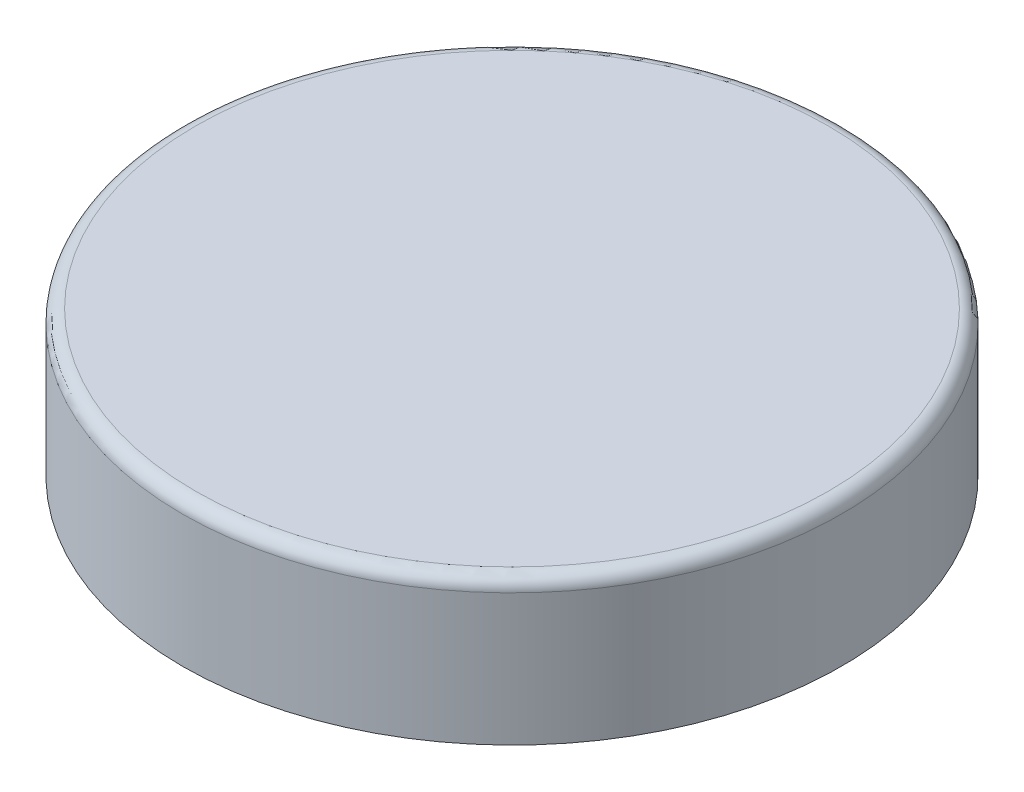
ISO-10303-21;
HEADER;
FILE_DESCRIPTION(('STEP AP214'),'2;1');
FILE_NAME('part.step','',(''),(''),'','','');
FILE_SCHEMA(('AUTOMOTIVE_DESIGN { 1 0 10303 214 1 1 1 1 }'));
ENDSEC;
DATA;
#1=APPLICATION_CONTEXT('core data for automotive mechanical design processes');
#2=APPLICATION_PROTOCOL_DEFINITION('international standard','automotive_design',2000,#1);
#3=PRODUCT_CONTEXT('',#1,'mechanical');
#4=PRODUCT('Part','Part','',(#3));
#5=PRODUCT_RELATED_PRODUCT_CATEGORY('part','',(#4));
#6=PRODUCT_DEFINITION_FORMATION('','',#4);
#7=PRODUCT_DEFINITION_CONTEXT('part definition',#1,'design');
#8=PRODUCT_DEFINITION('design','',#6,#7);
#9=PRODUCT_DEFINITION_SHAPE('','',#8);
#10=(LENGTH_UNIT() NAMED_UNIT(*) SI_UNIT(.MILLI.,.METRE.));
#11=(NAMED_UNIT(*) PLANE_ANGLE_UNIT() SI_UNIT($,.RADIAN.));
#12=(NAMED_UNIT(*) SI_UNIT($,.STERADIAN.) SOLID_ANGLE_UNIT());
#13=UNCERTAINTY_MEASURE_WITH_UNIT(LENGTH_MEASURE(1.E-05),#10,'distance_accuracy_value','');
#14=(GEOMETRIC_REPRESENTATION_CONTEXT(3) GLOBAL_UNCERTAINTY_ASSIGNED_CONTEXT((#13)) GLOBAL_UNIT_ASSIGNED_CONTEXT((#10,
#11,#12)) REPRESENTATION_CONTEXT('',''));
#15=CARTESIAN_POINT('',(0.,0.,0.));
#16=DIRECTION('',(0.,0.,1.));
#17=DIRECTION('',(1.,0.,0.));
#18=AXIS2_PLACEMENT_3D('',#15,#16,#17);
#19=CARTESIAN_POINT('',(0.,11.,0.));
#20=DIRECTION('',(0.,-1.,0.));
#21=DIRECTION('',(0.,0.,-1.));
#22=AXIS2_PLACEMENT_3D('',#19,#20,#21);
#23=CYLINDRICAL_SURFACE('',#22,25.);
#24=CARTESIAN_POINT('',(0.,10.,0.));
#25=DIRECTION('',(0.,1.,0.));
#26=DIRECTION('',(0.,0.,1.));
#27=AXIS2_PLACEMENT_3D('',#24,#25,#26);
#28=CIRCLE('',#27,25.);
#29=CARTESIAN_POINT('',(0.,10.,25.));
#30=VERTEX_POINT('',#29);
#31=EDGE_CURVE('E10',#30,#30,#28,.F.);
#32=ORIENTED_EDGE('',*,*,#31,.T.);
#33=EDGE_LOOP('',(#32));
#34=FACE_BOUND('',#33,.T.);
#35=CARTESIAN_POINT('',(0.,0.,0.));
#36=DIRECTION('',(0.,1.,0.));
#37=DIRECTION('',(0.,0.,1.));
#38=AXIS2_PLACEMENT_3D('',#35,#36,#37);
#39=CIRCLE('',#38,25.);
#40=CARTESIAN_POINT('',(0.,0.,25.));
#41=VERTEX_POINT('',#40);
#42=EDGE_CURVE('E42',#41,#41,#39,.T.);
#43=ORIENTED_EDGE('',*,*,#42,.T.);
#44=EDGE_LOOP('',(#43));
#45=FACE_BOUND('',#44,.T.);
#46=ADVANCED_FACE('F31',(#34,#45),#23,.T.);
#47=CARTESIAN_POINT('',(0.,11.,0.));
#48=DIRECTION('',(0.,1.,0.));
#49=DIRECTION('',(0.,0.,1.));
#50=AXIS2_PLACEMENT_3D('',#47,#48,#49);
#51=PLANE('',#50);
#52=CARTESIAN_POINT('',(0.,11.,0.));
#53=DIRECTION('',(0.,1.,0.));
#54=DIRECTION('',(0.,0.,1.));
#55=AXIS2_PLACEMENT_3D('',#52,#53,#54);
#56=CIRCLE('',#55,24.);
#57=CARTESIAN_POINT('',(0.,11.,24.));
#58=VERTEX_POINT('',#57);
#59=EDGE_CURVE('E38',#58,#58,#56,.T.);
#60=ORIENTED_EDGE('',*,*,#59,.T.);
#61=EDGE_LOOP('',(#60));
#62=FACE_BOUND('',#61,.T.);
#63=ADVANCED_FACE('F67',(#62),#51,.T.);
#64=CARTESIAN_POINT('',(0.,0.,0.));
#65=DIRECTION('',(0.,1.,0.));
#66=DIRECTION('',(0.,0.,1.));
#67=AXIS2_PLACEMENT_3D('',#64,#65,#66);
#68=PLANE('',#67);
#69=CARTESIAN_POINT('',(0.,0.,0.));
#70=DIRECTION('',(0.,1.,0.));
#71=DIRECTION('',(0.,0.,1.));
#72=AXIS2_PLACEMENT_3D('',#69,#70,#71);
#73=CIRCLE('',#72,24.);
#74=CARTESIAN_POINT('',(0.,0.,24.));
#75=VERTEX_POINT('',#74);
#76=EDGE_CURVE('E49',#75,#75,#73,.T.);
#77=ORIENTED_EDGE('',*,*,#76,.T.);
#78=EDGE_LOOP('',(#77));
#79=FACE_BOUND('',#78,.T.);
#80=ORIENTED_EDGE('',*,*,#42,.F.);
#81=EDGE_LOOP('',(#80));
#82=FACE_BOUND('',#81,.T.);
#83=ADVANCED_FACE('F71',(#79,#82),#68,.F.);
#84=CARTESIAN_POINT('',(0.,10.,0.));
#85=DIRECTION('',(0.,1.,0.));
#86=DIRECTION('',(0.,0.,1.));
#87=AXIS2_PLACEMENT_3D('',#84,#85,#86);
#88=TOROIDAL_SURFACE('',#87,24.,1.);
#89=ORIENTED_EDGE('',*,*,#31,.F.);
#90=EDGE_LOOP('',(#89));
#91=FACE_BOUND('',#90,.T.);
#92=ORIENTED_EDGE('',*,*,#59,.F.);
#93=EDGE_LOOP('',(#92));
#94=FACE_BOUND('',#93,.T.);
#95=ADVANCED_FACE('F33',(#91,#94),#88,.T.);
#96=CARTESIAN_POINT('',(0.,11.,0.));
#97=DIRECTION('',(0.,-1.,0.));
#98=DIRECTION('',(0.,0.,-1.));
#99=AXIS2_PLACEMENT_3D('',#96,#97,#98);
#100=CYLINDRICAL_SURFACE('',#99,24.);
#101=CARTESIAN_POINT('',(0.,10.,0.));
#102=DIRECTION('',(0.,1.,0.));
#103=DIRECTION('',(0.,0.,1.));
#104=AXIS2_PLACEMENT_3D('',#101,#102,#103);
#105=CIRCLE('',#104,24.);
#106=CARTESIAN_POINT('',(0.,10.,24.));
#107=VERTEX_POINT('',#106);
#108=EDGE_CURVE('E46',#107,#107,#105,.T.);
#109=ORIENTED_EDGE('',*,*,#108,.T.);
#110=EDGE_LOOP('',(#109));
#111=FACE_BOUND('',#110,.T.);
#112=ORIENTED_EDGE('',*,*,#76,.F.);
#113=EDGE_LOOP('',(#112));
#114=FACE_BOUND('',#113,.T.);
#115=ADVANCED_FACE('F55',(#111,#114),#100,.F.);
#116=CARTESIAN_POINT('',(0.,10.,0.));
#117=DIRECTION('',(0.,1.,0.));
#118=DIRECTION('',(0.,0.,1.));
#119=AXIS2_PLACEMENT_3D('',#116,#117,#118);
#120=PLANE('',#119);
#121=ORIENTED_EDGE('',*,*,#108,.F.);
#122=EDGE_LOOP('',(#121));
#123=FACE_BOUND('',#122,.T.);
#124=ADVANCED_FACE('F58',(#123),#120,.F.);
#125=CLOSED_SHELL('',(#46,#63,#83,#95,#115,#124));
#126=MANIFOLD_SOLID_BREP('B2',#125);
#127=ADVANCED_BREP_SHAPE_REPRESENTATION('',(#18,#126),#14);
#128=SHAPE_DEFINITION_REPRESENTATION(#9,#127);
ENDSEC;
END-ISO-10303-21;
